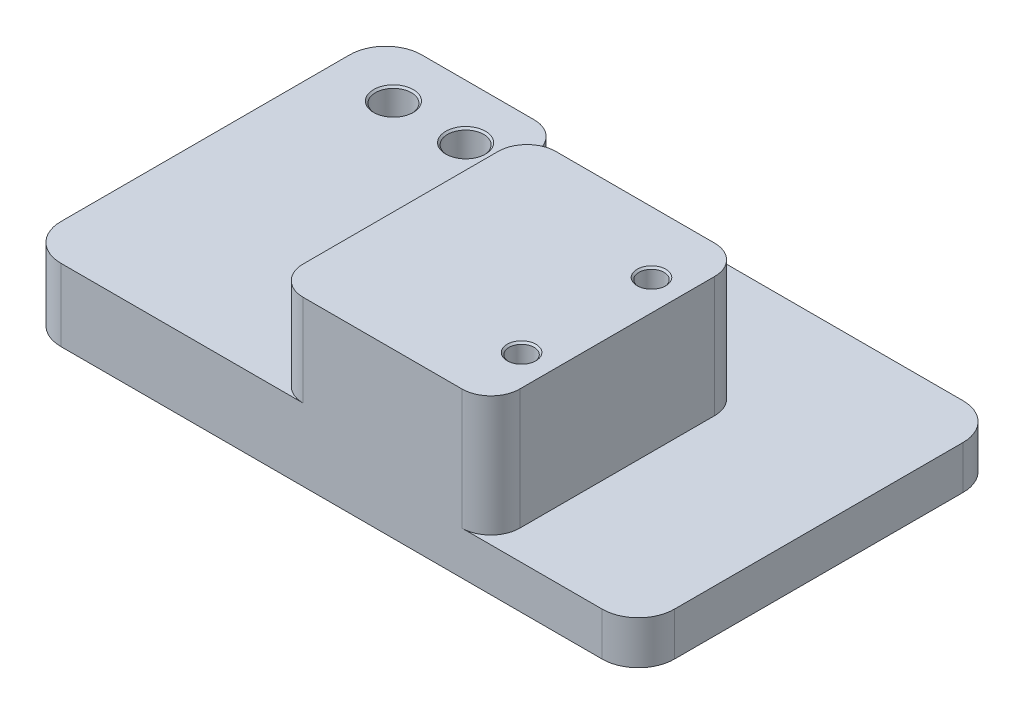
ISO-10303-21;
HEADER;
FILE_DESCRIPTION(('STEP AP214'),'2;1');
FILE_NAME('part.step','',(''),(''),'','','');
FILE_SCHEMA(('AUTOMOTIVE_DESIGN { 1 0 10303 214 1 1 1 1 }'));
ENDSEC;
DATA;
#1=APPLICATION_CONTEXT('core data for automotive mechanical design processes');
#2=APPLICATION_PROTOCOL_DEFINITION('international standard','automotive_design',2000,#1);
#3=PRODUCT_CONTEXT('',#1,'mechanical');
#4=PRODUCT('Part','Part','',(#3));
#5=PRODUCT_RELATED_PRODUCT_CATEGORY('part','',(#4));
#6=PRODUCT_DEFINITION_FORMATION('','',#4);
#7=PRODUCT_DEFINITION_CONTEXT('part definition',#1,'design');
#8=PRODUCT_DEFINITION('design','',#6,#7);
#9=PRODUCT_DEFINITION_SHAPE('','',#8);
#10=(LENGTH_UNIT() NAMED_UNIT(*) SI_UNIT(.MILLI.,.METRE.));
#11=(NAMED_UNIT(*) PLANE_ANGLE_UNIT() SI_UNIT($,.RADIAN.));
#12=(NAMED_UNIT(*) SI_UNIT($,.STERADIAN.) SOLID_ANGLE_UNIT());
#13=UNCERTAINTY_MEASURE_WITH_UNIT(LENGTH_MEASURE(1.E-05),#10,'distance_accuracy_value','');
#14=(GEOMETRIC_REPRESENTATION_CONTEXT(3) GLOBAL_UNCERTAINTY_ASSIGNED_CONTEXT((#13)) GLOBAL_UNIT_ASSIGNED_CONTEXT((#10,
#11,#12)) REPRESENTATION_CONTEXT('',''));
#15=CARTESIAN_POINT('',(0.,0.,0.));
#16=DIRECTION('',(0.,0.,1.));
#17=DIRECTION('',(1.,0.,0.));
#18=AXIS2_PLACEMENT_3D('',#15,#16,#17);
#19=CARTESIAN_POINT('',(0.,6.,0.));
#20=DIRECTION('',(0.,-1.,0.));
#21=DIRECTION('',(0.,0.,-1.));
#22=AXIS2_PLACEMENT_3D('',#19,#20,#21);
#23=PLANE('',#22);
#24=DIRECTION('',(0.,0.,-1.));
#25=VECTOR('',#24,1.);
#26=CARTESIAN_POINT('',(24.574331446899,6.,-50.));
#27=LINE('',#26,#25);
#28=CARTESIAN_POINT('',(24.574331446899,6.,-39.));
#29=VERTEX_POINT('',#28);
#30=CARTESIAN_POINT('',(24.574331446899,6.,-46.));
#31=VERTEX_POINT('',#30);
#32=EDGE_CURVE('E399',#29,#31,#27,.T.);
#33=ORIENTED_EDGE('',*,*,#32,.F.);
#34=CARTESIAN_POINT('',(28.574331446899,6.,-39.));
#35=DIRECTION('',(0.,-1.,0.));
#36=DIRECTION('',(0.,0.,-1.));
#37=AXIS2_PLACEMENT_3D('',#34,#35,#36);
#38=CIRCLE('',#37,4.);
#39=CARTESIAN_POINT('',(28.574331446899,6.,-35.));
#40=VERTEX_POINT('',#39);
#41=EDGE_CURVE('E328',#29,#40,#38,.F.);
#42=ORIENTED_EDGE('',*,*,#41,.T.);
#43=DIRECTION('',(-1.,0.,0.));
#44=VECTOR('',#43,1.);
#45=CARTESIAN_POINT('',(64.574331446899,6.,-35.));
#46=LINE('',#45,#44);
#47=CARTESIAN_POINT('',(60.574331446899,6.,-35.));
#48=VERTEX_POINT('',#47);
#49=EDGE_CURVE('E405',#48,#40,#46,.T.);
#50=ORIENTED_EDGE('',*,*,#49,.F.);
#51=CARTESIAN_POINT('',(60.574331446899,6.,-31.));
#52=DIRECTION('',(0.,-1.,0.));
#53=DIRECTION('',(0.,0.,-1.));
#54=AXIS2_PLACEMENT_3D('',#51,#52,#53);
#55=CIRCLE('',#54,4.);
#56=CARTESIAN_POINT('',(64.574331446899,6.,-31.));
#57=VERTEX_POINT('',#56);
#58=EDGE_CURVE('E314',#48,#57,#55,.T.);
#59=ORIENTED_EDGE('',*,*,#58,.T.);
#60=DIRECTION('',(0.,0.,-1.));
#61=VECTOR('',#60,1.);
#62=CARTESIAN_POINT('',(64.574331446899,6.,0.));
#63=LINE('',#62,#61);
#64=CARTESIAN_POINT('',(64.574331446899,6.,-4.));
#65=VERTEX_POINT('',#64);
#66=EDGE_CURVE('E832',#65,#57,#63,.T.);
#67=ORIENTED_EDGE('',*,*,#66,.F.);
#68=CARTESIAN_POINT('',(60.574331446899,6.,-4.));
#69=DIRECTION('',(0.,-1.,0.));
#70=DIRECTION('',(0.,0.,-1.));
#71=AXIS2_PLACEMENT_3D('',#68,#69,#70);
#72=CIRCLE('',#71,4.);
#73=CARTESIAN_POINT('',(60.574331446899,6.,0.));
#74=VERTEX_POINT('',#73);
#75=EDGE_CURVE('E310',#65,#74,#72,.T.);
#76=ORIENTED_EDGE('',*,*,#75,.T.);
#77=DIRECTION('',(1.,0.,0.));
#78=VECTOR('',#77,1.);
#79=CARTESIAN_POINT('',(0.,6.,0.));
#80=LINE('',#79,#78);
#81=CARTESIAN_POINT('',(80.,6.,0.));
#82=VERTEX_POINT('',#81);
#83=EDGE_CURVE('E218',#74,#82,#80,.T.);
#84=ORIENTED_EDGE('',*,*,#83,.T.);
#85=CARTESIAN_POINT('',(80.,6.,-5.));
#86=DIRECTION('',(0.,-1.,0.));
#87=DIRECTION('',(0.,0.,-1.));
#88=AXIS2_PLACEMENT_3D('',#85,#86,#87);
#89=CIRCLE('',#88,5.);
#90=CARTESIAN_POINT('',(85.,6.,-5.));
#91=VERTEX_POINT('',#90);
#92=EDGE_CURVE('E243',#82,#91,#89,.F.);
#93=ORIENTED_EDGE('',*,*,#92,.T.);
#94=DIRECTION('',(0.,0.,-1.));
#95=VECTOR('',#94,1.);
#96=CARTESIAN_POINT('',(85.,6.,0.));
#97=LINE('',#96,#95);
#98=CARTESIAN_POINT('',(85.,6.,-45.));
#99=VERTEX_POINT('',#98);
#100=EDGE_CURVE('E224',#91,#99,#97,.T.);
#101=ORIENTED_EDGE('',*,*,#100,.T.);
#102=CARTESIAN_POINT('',(80.,6.,-45.));
#103=DIRECTION('',(0.,-1.,0.));
#104=DIRECTION('',(0.,0.,-1.));
#105=AXIS2_PLACEMENT_3D('',#102,#103,#104);
#106=CIRCLE('',#105,5.);
#107=CARTESIAN_POINT('',(80.,6.,-50.));
#108=VERTEX_POINT('',#107);
#109=EDGE_CURVE('E246',#99,#108,#106,.F.);
#110=ORIENTED_EDGE('',*,*,#109,.T.);
#111=DIRECTION('',(-1.,0.,0.));
#112=VECTOR('',#111,1.);
#113=CARTESIAN_POINT('',(0.,6.,-50.));
#114=LINE('',#113,#112);
#115=CARTESIAN_POINT('',(20.574331446899,6.,-50.));
#116=VERTEX_POINT('',#115);
#117=EDGE_CURVE('E209',#108,#116,#114,.T.);
#118=ORIENTED_EDGE('',*,*,#117,.T.);
#119=CARTESIAN_POINT('',(20.574331446899,6.,-46.));
#120=DIRECTION('',(0.,-1.,0.));
#121=DIRECTION('',(0.,0.,-1.));
#122=AXIS2_PLACEMENT_3D('',#119,#120,#121);
#123=CIRCLE('',#122,4.);
#124=EDGE_CURVE('E62',#116,#31,#123,.T.);
#125=ORIENTED_EDGE('',*,*,#124,.T.);
#126=EDGE_LOOP('',(#33,#42,#50,#59,#67,#76,#84,#93,#101,#110,#118,#125));
#127=FACE_BOUND('',#126,.T.);
#128=ADVANCED_FACE('F45',(#127),#23,.F.);
#129=CARTESIAN_POINT('',(0.,6.,0.));
#130=DIRECTION('',(1.,0.,0.));
#131=DIRECTION('',(0.,0.,-1.));
#132=AXIS2_PLACEMENT_3D('',#129,#130,#131);
#133=PLANE('',#132);
#134=DIRECTION('',(0.,0.,1.));
#135=VECTOR('',#134,1.);
#136=CARTESIAN_POINT('',(0.,10.,0.));
#137=LINE('',#136,#135);
#138=CARTESIAN_POINT('',(0.,10.,-45.));
#139=VERTEX_POINT('',#138);
#140=CARTESIAN_POINT('',(0.,10.,-5.));
#141=VERTEX_POINT('',#140);
#142=EDGE_CURVE('E417',#139,#141,#137,.T.);
#143=ORIENTED_EDGE('',*,*,#142,.F.);
#144=DIRECTION('',(0.,-1.,0.));
#145=VECTOR('',#144,1.);
#146=CARTESIAN_POINT('',(0.,6.,-45.));
#147=LINE('',#146,#145);
#148=CARTESIAN_POINT('',(0.,0.,-45.));
#149=VERTEX_POINT('',#148);
#150=EDGE_CURVE('E259',#139,#149,#147,.T.);
#151=ORIENTED_EDGE('',*,*,#150,.T.);
#152=DIRECTION('',(0.,0.,1.));
#153=VECTOR('',#152,1.);
#154=CARTESIAN_POINT('',(0.,0.,0.));
#155=LINE('',#154,#153);
#156=CARTESIAN_POINT('',(0.,0.,-5.));
#157=VERTEX_POINT('',#156);
#158=EDGE_CURVE('E421',#149,#157,#155,.T.);
#159=ORIENTED_EDGE('',*,*,#158,.T.);
#160=DIRECTION('',(0.,-1.,0.));
#161=VECTOR('',#160,1.);
#162=CARTESIAN_POINT('',(0.,6.,-5.));
#163=LINE('',#162,#161);
#164=EDGE_CURVE('E256',#157,#141,#163,.F.);
#165=ORIENTED_EDGE('',*,*,#164,.T.);
#166=EDGE_LOOP('',(#143,#151,#159,#165));
#167=FACE_BOUND('',#166,.T.);
#168=ADVANCED_FACE('F453',(#167),#133,.F.);
#169=CARTESIAN_POINT('',(0.,6.,0.));
#170=DIRECTION('',(0.,0.,-1.));
#171=DIRECTION('',(-1.,0.,0.));
#172=AXIS2_PLACEMENT_3D('',#169,#170,#171);
#173=PLANE('',#172);
#174=ORIENTED_EDGE('',*,*,#83,.F.);
#175=DIRECTION('',(0.,-1.,0.));
#176=VECTOR('',#175,1.);
#177=CARTESIAN_POINT('',(60.574331446899,6.,0.));
#178=LINE('',#177,#176);
#179=CARTESIAN_POINT('',(60.574331446899,22.7,0.));
#180=VERTEX_POINT('',#179);
#181=EDGE_CURVE('E280',#74,#180,#178,.F.);
#182=ORIENTED_EDGE('',*,*,#181,.T.);
#183=DIRECTION('',(1.,0.,0.));
#184=VECTOR('',#183,1.);
#185=CARTESIAN_POINT('',(9.574331446899,22.7,0.));
#186=LINE('',#185,#184);
#187=CARTESIAN_POINT('',(38.574331446899,22.7,0.));
#188=VERTEX_POINT('',#187);
#189=EDGE_CURVE('E828',#188,#180,#186,.T.);
#190=ORIENTED_EDGE('',*,*,#189,.F.);
#191=DIRECTION('',(0.,1.,0.));
#192=VECTOR('',#191,1.);
#193=CARTESIAN_POINT('',(38.574331446899,6.,0.));
#194=LINE('',#193,#192);
#195=CARTESIAN_POINT('',(38.574331446899,10.,0.));
#196=VERTEX_POINT('',#195);
#197=EDGE_CURVE('E276',#188,#196,#194,.F.);
#198=ORIENTED_EDGE('',*,*,#197,.T.);
#199=DIRECTION('',(1.,0.,0.));
#200=VECTOR('',#199,1.);
#201=CARTESIAN_POINT('',(9.57433144689901,10.,0.));
#202=LINE('',#201,#200);
#203=CARTESIAN_POINT('',(5.,10.,0.));
#204=VERTEX_POINT('',#203);
#205=EDGE_CURVE('E408',#204,#196,#202,.T.);
#206=ORIENTED_EDGE('',*,*,#205,.F.);
#207=DIRECTION('',(0.,-1.,0.));
#208=VECTOR('',#207,1.);
#209=CARTESIAN_POINT('',(5.,6.,0.));
#210=LINE('',#209,#208);
#211=CARTESIAN_POINT('',(5.,0.,0.));
#212=VERTEX_POINT('',#211);
#213=EDGE_CURVE('E249',#204,#212,#210,.T.);
#214=ORIENTED_EDGE('',*,*,#213,.T.);
#215=DIRECTION('',(1.,0.,0.));
#216=VECTOR('',#215,1.);
#217=CARTESIAN_POINT('',(0.,0.,0.));
#218=LINE('',#217,#216);
#219=CARTESIAN_POINT('',(80.,0.,0.));
#220=VERTEX_POINT('',#219);
#221=EDGE_CURVE('E226',#212,#220,#218,.T.);
#222=ORIENTED_EDGE('',*,*,#221,.T.);
#223=DIRECTION('',(0.,-1.,0.));
#224=VECTOR('',#223,1.);
#225=CARTESIAN_POINT('',(80.,6.,0.));
#226=LINE('',#225,#224);
#227=EDGE_CURVE('E253',#220,#82,#226,.F.);
#228=ORIENTED_EDGE('',*,*,#227,.T.);
#229=EDGE_LOOP('',(#174,#182,#190,#198,#206,#214,#222,#228));
#230=FACE_BOUND('',#229,.T.);
#231=ADVANCED_FACE('F436',(#230),#173,.F.);
#232=CARTESIAN_POINT('',(85.,6.,0.));
#233=DIRECTION('',(-1.,0.,0.));
#234=DIRECTION('',(0.,0.,1.));
#235=AXIS2_PLACEMENT_3D('',#232,#233,#234);
#236=PLANE('',#235);
#237=DIRECTION('',(0.,0.,-1.));
#238=VECTOR('',#237,1.);
#239=CARTESIAN_POINT('',(85.,0.,0.));
#240=LINE('',#239,#238);
#241=CARTESIAN_POINT('',(85.,0.,-5.));
#242=VERTEX_POINT('',#241);
#243=CARTESIAN_POINT('',(85.,0.,-45.));
#244=VERTEX_POINT('',#243);
#245=EDGE_CURVE('E219',#242,#244,#240,.T.);
#246=ORIENTED_EDGE('',*,*,#245,.T.);
#247=DIRECTION('',(0.,-1.,0.));
#248=VECTOR('',#247,1.);
#249=CARTESIAN_POINT('',(85.,6.,-45.));
#250=LINE('',#249,#248);
#251=EDGE_CURVE('E191',#244,#99,#250,.F.);
#252=ORIENTED_EDGE('',*,*,#251,.T.);
#253=ORIENTED_EDGE('',*,*,#100,.F.);
#254=DIRECTION('',(0.,-1.,0.));
#255=VECTOR('',#254,1.);
#256=CARTESIAN_POINT('',(85.,6.,-5.));
#257=LINE('',#256,#255);
#258=EDGE_CURVE('E197',#91,#242,#257,.T.);
#259=ORIENTED_EDGE('',*,*,#258,.T.);
#260=EDGE_LOOP('',(#246,#252,#253,#259));
#261=FACE_BOUND('',#260,.T.);
#262=ADVANCED_FACE('F445',(#261),#236,.F.);
#263=CARTESIAN_POINT('',(0.,6.,-50.));
#264=DIRECTION('',(0.,0.,1.));
#265=DIRECTION('',(1.,0.,0.));
#266=AXIS2_PLACEMENT_3D('',#263,#264,#265);
#267=PLANE('',#266);
#268=DIRECTION('',(-1.,0.,0.));
#269=VECTOR('',#268,1.);
#270=CARTESIAN_POINT('',(0.,10.,-50.));
#271=LINE('',#270,#269);
#272=CARTESIAN_POINT('',(20.574331446899,10.,-50.));
#273=VERTEX_POINT('',#272);
#274=CARTESIAN_POINT('',(5.,10.,-50.));
#275=VERTEX_POINT('',#274);
#276=EDGE_CURVE('E414',#273,#275,#271,.T.);
#277=ORIENTED_EDGE('',*,*,#276,.F.);
#278=DIRECTION('',(0.,-1.,0.));
#279=VECTOR('',#278,1.);
#280=CARTESIAN_POINT('',(20.574331446899,6.,-50.));
#281=LINE('',#280,#279);
#282=EDGE_CURVE('E337',#273,#116,#281,.T.);
#283=ORIENTED_EDGE('',*,*,#282,.T.);
#284=ORIENTED_EDGE('',*,*,#117,.F.);
#285=DIRECTION('',(0.,-1.,0.));
#286=VECTOR('',#285,1.);
#287=CARTESIAN_POINT('',(80.,6.,-50.));
#288=LINE('',#287,#286);
#289=CARTESIAN_POINT('',(80.,0.,-50.));
#290=VERTEX_POINT('',#289);
#291=EDGE_CURVE('E190',#108,#290,#288,.T.);
#292=ORIENTED_EDGE('',*,*,#291,.T.);
#293=DIRECTION('',(-1.,0.,0.));
#294=VECTOR('',#293,1.);
#295=CARTESIAN_POINT('',(0.,0.,-50.));
#296=LINE('',#295,#294);
#297=CARTESIAN_POINT('',(5.,0.,-50.));
#298=VERTEX_POINT('',#297);
#299=EDGE_CURVE('E206',#290,#298,#296,.T.);
#300=ORIENTED_EDGE('',*,*,#299,.T.);
#301=DIRECTION('',(0.,-1.,0.));
#302=VECTOR('',#301,1.);
#303=CARTESIAN_POINT('',(5.,6.,-50.));
#304=LINE('',#303,#302);
#305=EDGE_CURVE('E212',#298,#275,#304,.F.);
#306=ORIENTED_EDGE('',*,*,#305,.T.);
#307=EDGE_LOOP('',(#277,#283,#284,#292,#300,#306));
#308=FACE_BOUND('',#307,.T.);
#309=ADVANCED_FACE('F204',(#308),#267,.F.);
#310=CARTESIAN_POINT('',(0.,0.,0.));
#311=DIRECTION('',(0.,-1.,0.));
#312=DIRECTION('',(0.,0.,-1.));
#313=AXIS2_PLACEMENT_3D('',#310,#311,#312);
#314=PLANE('',#313);
#315=CARTESIAN_POINT('',(18.574331446899,0.,-42.5));
#316=DIRECTION('',(0.,-1.,0.));
#317=DIRECTION('',(0.,0.,-1.));
#318=AXIS2_PLACEMENT_3D('',#315,#316,#317);
#319=CIRCLE('',#318,2.5);
#320=CARTESIAN_POINT('',(18.574331446899,0.,-45.));
#321=VERTEX_POINT('',#320);
#322=EDGE_CURVE('E393',#321,#321,#319,.T.);
#323=ORIENTED_EDGE('',*,*,#322,.F.);
#324=EDGE_LOOP('',(#323));
#325=FACE_BOUND('',#324,.T.);
#326=CARTESIAN_POINT('',(8.574331446899,0.,-42.5));
#327=DIRECTION('',(0.,-1.,0.));
#328=DIRECTION('',(0.,0.,-1.));
#329=AXIS2_PLACEMENT_3D('',#326,#327,#328);
#330=CIRCLE('',#329,2.5);
#331=CARTESIAN_POINT('',(8.574331446899,0.,-45.));
#332=VERTEX_POINT('',#331);
#333=EDGE_CURVE('E390',#332,#332,#330,.T.);
#334=ORIENTED_EDGE('',*,*,#333,.F.);
#335=EDGE_LOOP('',(#334));
#336=FACE_BOUND('',#335,.T.);
#337=ORIENTED_EDGE('',*,*,#299,.F.);
#338=CARTESIAN_POINT('',(80.,0.,-45.));
#339=DIRECTION('',(0.,-1.,0.));
#340=DIRECTION('',(0.,0.,-1.));
#341=AXIS2_PLACEMENT_3D('',#338,#339,#340);
#342=CIRCLE('',#341,5.);
#343=EDGE_CURVE('E186',#290,#244,#342,.T.);
#344=ORIENTED_EDGE('',*,*,#343,.T.);
#345=ORIENTED_EDGE('',*,*,#245,.F.);
#346=CARTESIAN_POINT('',(80.,0.,-5.));
#347=DIRECTION('',(0.,-1.,0.));
#348=DIRECTION('',(0.,0.,-1.));
#349=AXIS2_PLACEMENT_3D('',#346,#347,#348);
#350=CIRCLE('',#349,5.);
#351=EDGE_CURVE('E198',#242,#220,#350,.T.);
#352=ORIENTED_EDGE('',*,*,#351,.T.);
#353=ORIENTED_EDGE('',*,*,#221,.F.);
#354=CARTESIAN_POINT('',(5.,0.,-5.));
#355=DIRECTION('',(0.,-1.,0.));
#356=DIRECTION('',(0.,0.,-1.));
#357=AXIS2_PLACEMENT_3D('',#354,#355,#356);
#358=CIRCLE('',#357,5.);
#359=EDGE_CURVE('E211',#212,#157,#358,.T.);
#360=ORIENTED_EDGE('',*,*,#359,.T.);
#361=ORIENTED_EDGE('',*,*,#158,.F.);
#362=CARTESIAN_POINT('',(5.,0.,-45.));
#363=DIRECTION('',(0.,-1.,0.));
#364=DIRECTION('',(0.,0.,-1.));
#365=AXIS2_PLACEMENT_3D('',#362,#363,#364);
#366=CIRCLE('',#365,5.);
#367=EDGE_CURVE('E216',#149,#298,#366,.T.);
#368=ORIENTED_EDGE('',*,*,#367,.T.);
#369=EDGE_LOOP('',(#337,#344,#345,#352,#353,#360,#361,#368));
#370=FACE_BOUND('',#369,.T.);
#371=ADVANCED_FACE('F214',(#325,#336,#370),#314,.T.);
#372=CARTESIAN_POINT('',(24.574331446899,10.,-50.));
#373=DIRECTION('',(-1.,0.,0.));
#374=DIRECTION('',(0.,0.,1.));
#375=AXIS2_PLACEMENT_3D('',#372,#373,#374);
#376=PLANE('',#375);
#377=ORIENTED_EDGE('',*,*,#32,.T.);
#378=DIRECTION('',(0.,-1.,0.));
#379=VECTOR('',#378,1.);
#380=CARTESIAN_POINT('',(24.574331446899,10.,-46.));
#381=LINE('',#380,#379);
#382=CARTESIAN_POINT('',(24.574331446899,10.,-46.));
#383=VERTEX_POINT('',#382);
#384=EDGE_CURVE('E69',#31,#383,#381,.F.);
#385=ORIENTED_EDGE('',*,*,#384,.T.);
#386=DIRECTION('',(0.,0.,-1.));
#387=VECTOR('',#386,1.);
#388=CARTESIAN_POINT('',(24.574331446899,10.,-50.));
#389=LINE('',#388,#387);
#390=CARTESIAN_POINT('',(24.574331446899,10.,-39.));
#391=VERTEX_POINT('',#390);
#392=EDGE_CURVE('E411',#391,#383,#389,.T.);
#393=ORIENTED_EDGE('',*,*,#392,.F.);
#394=DIRECTION('',(0.,-1.,0.));
#395=VECTOR('',#394,1.);
#396=CARTESIAN_POINT('',(24.574331446899,6.,-39.));
#397=LINE('',#396,#395);
#398=EDGE_CURVE('E324',#391,#29,#397,.T.);
#399=ORIENTED_EDGE('',*,*,#398,.T.);
#400=EDGE_LOOP('',(#377,#385,#393,#399));
#401=FACE_BOUND('',#400,.T.);
#402=ADVANCED_FACE('F464',(#401),#376,.F.);
#403=CARTESIAN_POINT('',(0.,10.,0.));
#404=DIRECTION('',(0.,-1.,0.));
#405=DIRECTION('',(0.,0.,-1.));
#406=AXIS2_PLACEMENT_3D('',#403,#404,#405);
#407=PLANE('',#406);
#408=CARTESIAN_POINT('',(8.574331446899,10.,-42.5));
#409=DIRECTION('',(0.,-1.,0.));
#410=DIRECTION('',(0.,0.,-1.));
#411=AXIS2_PLACEMENT_3D('',#408,#409,#410);
#412=CIRCLE('',#411,2.74999999999999);
#413=CARTESIAN_POINT('',(8.574331446899,10.,-45.25));
#414=VERTEX_POINT('',#413);
#415=EDGE_CURVE('E55',#414,#414,#412,.T.);
#416=ORIENTED_EDGE('',*,*,#415,.T.);
#417=EDGE_LOOP('',(#416));
#418=FACE_BOUND('',#417,.T.);
#419=CARTESIAN_POINT('',(18.574331446899,10.,-42.5));
#420=DIRECTION('',(0.,-1.,0.));
#421=DIRECTION('',(0.,0.,-1.));
#422=AXIS2_PLACEMENT_3D('',#419,#420,#421);
#423=CIRCLE('',#422,2.75);
#424=CARTESIAN_POINT('',(18.574331446899,10.,-45.25));
#425=VERTEX_POINT('',#424);
#426=EDGE_CURVE('E367',#425,#425,#423,.T.);
#427=ORIENTED_EDGE('',*,*,#426,.T.);
#428=EDGE_LOOP('',(#427));
#429=FACE_BOUND('',#428,.T.);
#430=ORIENTED_EDGE('',*,*,#392,.T.);
#431=CARTESIAN_POINT('',(20.574331446899,10.,-46.));
#432=DIRECTION('',(0.,-1.,0.));
#433=DIRECTION('',(0.,0.,-1.));
#434=AXIS2_PLACEMENT_3D('',#431,#432,#433);
#435=CIRCLE('',#434,4.);
#436=EDGE_CURVE('E342',#383,#273,#435,.F.);
#437=ORIENTED_EDGE('',*,*,#436,.T.);
#438=ORIENTED_EDGE('',*,*,#276,.T.);
#439=CARTESIAN_POINT('',(5.,10.,-45.));
#440=DIRECTION('',(0.,-1.,0.));
#441=DIRECTION('',(0.,0.,-1.));
#442=AXIS2_PLACEMENT_3D('',#439,#440,#441);
#443=CIRCLE('',#442,5.);
#444=EDGE_CURVE('E266',#275,#139,#443,.F.);
#445=ORIENTED_EDGE('',*,*,#444,.T.);
#446=ORIENTED_EDGE('',*,*,#142,.T.);
#447=CARTESIAN_POINT('',(5.,10.,-5.));
#448=DIRECTION('',(0.,-1.,0.));
#449=DIRECTION('',(0.,0.,-1.));
#450=AXIS2_PLACEMENT_3D('',#447,#448,#449);
#451=CIRCLE('',#450,5.);
#452=EDGE_CURVE('E263',#141,#204,#451,.F.);
#453=ORIENTED_EDGE('',*,*,#452,.T.);
#454=ORIENTED_EDGE('',*,*,#205,.T.);
#455=CARTESIAN_POINT('',(38.574331446899,10.,-4.));
#456=DIRECTION('',(0.,-1.,0.));
#457=DIRECTION('',(0.,0.,-1.));
#458=AXIS2_PLACEMENT_3D('',#455,#456,#457);
#459=CIRCLE('',#458,4.);
#460=CARTESIAN_POINT('',(34.574331446899,10.,-4.));
#461=VERTEX_POINT('',#460);
#462=EDGE_CURVE('E321',#196,#461,#459,.T.);
#463=ORIENTED_EDGE('',*,*,#462,.T.);
#464=DIRECTION('',(0.,0.,-1.));
#465=VECTOR('',#464,1.);
#466=CARTESIAN_POINT('',(34.574331446899,10.,-35.));
#467=LINE('',#466,#465);
#468=CARTESIAN_POINT('',(34.574331446899,10.,-31.));
#469=VERTEX_POINT('',#468);
#470=EDGE_CURVE('E850',#461,#469,#467,.T.);
#471=ORIENTED_EDGE('',*,*,#470,.T.);
#472=CARTESIAN_POINT('',(38.574331446899,10.,-31.));
#473=DIRECTION('',(0.,-1.,0.));
#474=DIRECTION('',(0.,0.,-1.));
#475=AXIS2_PLACEMENT_3D('',#472,#473,#474);
#476=CIRCLE('',#475,4.);
#477=CARTESIAN_POINT('',(38.574331446899,10.,-35.));
#478=VERTEX_POINT('',#477);
#479=EDGE_CURVE('E317',#469,#478,#476,.T.);
#480=ORIENTED_EDGE('',*,*,#479,.T.);
#481=DIRECTION('',(-1.,0.,0.));
#482=VECTOR('',#481,1.);
#483=CARTESIAN_POINT('',(9.57433144689901,10.,-35.));
#484=LINE('',#483,#482);
#485=CARTESIAN_POINT('',(28.574331446899,10.,-35.));
#486=VERTEX_POINT('',#485);
#487=EDGE_CURVE('E848',#478,#486,#484,.T.);
#488=ORIENTED_EDGE('',*,*,#487,.T.);
#489=CARTESIAN_POINT('',(28.574331446899,10.,-39.));
#490=DIRECTION('',(0.,-1.,0.));
#491=DIRECTION('',(0.,0.,-1.));
#492=AXIS2_PLACEMENT_3D('',#489,#490,#491);
#493=CIRCLE('',#492,4.);
#494=EDGE_CURVE('E334',#486,#391,#493,.T.);
#495=ORIENTED_EDGE('',*,*,#494,.T.);
#496=EDGE_LOOP('',(#430,#437,#438,#445,#446,#453,#454,#463,#471,#480,#488,#495));
#497=FACE_BOUND('',#496,.T.);
#498=ADVANCED_FACE('F374',(#418,#429,#497),#407,.F.);
#499=CARTESIAN_POINT('',(8.574331446899,-0.999999999999999,-42.5));
#500=DIRECTION('',(0.,1.,0.));
#501=DIRECTION('',(0.,0.,1.));
#502=AXIS2_PLACEMENT_3D('',#499,#500,#501);
#503=CYLINDRICAL_SURFACE('',#502,2.5);
#504=CARTESIAN_POINT('',(8.574331446899,9.75000000000001,-42.5));
#505=DIRECTION('',(0.,-1.,0.));
#506=DIRECTION('',(0.,0.,-1.));
#507=AXIS2_PLACEMENT_3D('',#504,#505,#506);
#508=CIRCLE('',#507,2.5);
#509=CARTESIAN_POINT('',(8.574331446899,9.75000000000001,-45.));
#510=VERTEX_POINT('',#509);
#511=EDGE_CURVE('E363',#510,#510,#508,.F.);
#512=ORIENTED_EDGE('',*,*,#511,.T.);
#513=EDGE_LOOP('',(#512));
#514=FACE_BOUND('',#513,.T.);
#515=ORIENTED_EDGE('',*,*,#333,.T.);
#516=EDGE_LOOP('',(#515));
#517=FACE_BOUND('',#516,.T.);
#518=ADVANCED_FACE('F383',(#514,#517),#503,.F.);
#519=CARTESIAN_POINT('',(18.574331446899,-0.999999999999999,-42.5));
#520=DIRECTION('',(0.,1.,0.));
#521=DIRECTION('',(0.,0.,1.));
#522=AXIS2_PLACEMENT_3D('',#519,#520,#521);
#523=CYLINDRICAL_SURFACE('',#522,2.5);
#524=CARTESIAN_POINT('',(18.574331446899,9.75,-42.5));
#525=DIRECTION('',(0.,-1.,0.));
#526=DIRECTION('',(0.,0.,-1.));
#527=AXIS2_PLACEMENT_3D('',#524,#525,#526);
#528=CIRCLE('',#527,2.5);
#529=CARTESIAN_POINT('',(18.574331446899,9.75,-45.));
#530=VERTEX_POINT('',#529);
#531=EDGE_CURVE('E11',#530,#530,#528,.F.);
#532=ORIENTED_EDGE('',*,*,#531,.T.);
#533=EDGE_LOOP('',(#532));
#534=FACE_BOUND('',#533,.T.);
#535=ORIENTED_EDGE('',*,*,#322,.T.);
#536=EDGE_LOOP('',(#535));
#537=FACE_BOUND('',#536,.T.);
#538=ADVANCED_FACE('F386',(#534,#537),#523,.F.);
#539=CARTESIAN_POINT('',(64.574331446899,22.7,-35.));
#540=DIRECTION('',(0.,0.,1.));
#541=DIRECTION('',(1.,0.,0.));
#542=AXIS2_PLACEMENT_3D('',#539,#540,#541);
#543=PLANE('',#542);
#544=ORIENTED_EDGE('',*,*,#49,.T.);
#545=DIRECTION('',(0.,-1.,0.));
#546=VECTOR('',#545,1.);
#547=CARTESIAN_POINT('',(28.574331446899,10.,-35.));
#548=LINE('',#547,#546);
#549=EDGE_CURVE('E331',#40,#486,#548,.F.);
#550=ORIENTED_EDGE('',*,*,#549,.T.);
#551=ORIENTED_EDGE('',*,*,#487,.F.);
#552=DIRECTION('',(0.,1.,0.));
#553=VECTOR('',#552,1.);
#554=CARTESIAN_POINT('',(38.574331446899,22.7,-35.));
#555=LINE('',#554,#553);
#556=CARTESIAN_POINT('',(38.574331446899,22.7,-35.));
#557=VERTEX_POINT('',#556);
#558=EDGE_CURVE('E295',#478,#557,#555,.T.);
#559=ORIENTED_EDGE('',*,*,#558,.T.);
#560=DIRECTION('',(-1.,0.,0.));
#561=VECTOR('',#560,1.);
#562=CARTESIAN_POINT('',(64.574331446899,22.7,-35.));
#563=LINE('',#562,#561);
#564=CARTESIAN_POINT('',(60.574331446899,22.7,-35.));
#565=VERTEX_POINT('',#564);
#566=EDGE_CURVE('E394',#565,#557,#563,.T.);
#567=ORIENTED_EDGE('',*,*,#566,.F.);
#568=DIRECTION('',(0.,-1.,0.));
#569=VECTOR('',#568,1.);
#570=CARTESIAN_POINT('',(60.574331446899,22.7,-35.));
#571=LINE('',#570,#569);
#572=EDGE_CURVE('E299',#565,#48,#571,.T.);
#573=ORIENTED_EDGE('',*,*,#572,.T.);
#574=EDGE_LOOP('',(#544,#550,#551,#559,#567,#573));
#575=FACE_BOUND('',#574,.T.);
#576=ADVANCED_FACE('F474',(#575),#543,.F.);
#577=CARTESIAN_POINT('',(64.574331446899,22.7,0.));
#578=DIRECTION('',(-1.,0.,0.));
#579=DIRECTION('',(0.,0.,1.));
#580=AXIS2_PLACEMENT_3D('',#577,#578,#579);
#581=PLANE('',#580);
#582=DIRECTION('',(0.,0.,-1.));
#583=VECTOR('',#582,1.);
#584=CARTESIAN_POINT('',(64.574331446899,22.7,0.));
#585=LINE('',#584,#583);
#586=CARTESIAN_POINT('',(64.574331446899,22.7,-4.));
#587=VERTEX_POINT('',#586);
#588=CARTESIAN_POINT('',(64.574331446899,22.7,-31.));
#589=VERTEX_POINT('',#588);
#590=EDGE_CURVE('E402',#587,#589,#585,.T.);
#591=ORIENTED_EDGE('',*,*,#590,.F.);
#592=DIRECTION('',(0.,-1.,0.));
#593=VECTOR('',#592,1.);
#594=CARTESIAN_POINT('',(64.574331446899,22.7,-4.));
#595=LINE('',#594,#593);
#596=EDGE_CURVE('E272',#587,#65,#595,.T.);
#597=ORIENTED_EDGE('',*,*,#596,.T.);
#598=ORIENTED_EDGE('',*,*,#66,.T.);
#599=DIRECTION('',(0.,-1.,0.));
#600=VECTOR('',#599,1.);
#601=CARTESIAN_POINT('',(64.574331446899,22.7,-31.));
#602=LINE('',#601,#600);
#603=EDGE_CURVE('E269',#57,#589,#602,.F.);
#604=ORIENTED_EDGE('',*,*,#603,.T.);
#605=EDGE_LOOP('',(#591,#597,#598,#604));
#606=FACE_BOUND('',#605,.T.);
#607=ADVANCED_FACE('F480',(#606),#581,.F.);
#608=CARTESIAN_POINT('',(0.,22.7,0.));
#609=DIRECTION('',(0.,1.,0.));
#610=DIRECTION('',(0.,0.,1.));
#611=AXIS2_PLACEMENT_3D('',#608,#609,#610);
#612=PLANE('',#611);
#613=CARTESIAN_POINT('',(60.324331446899,22.7,-8.50000000000001));
#614=DIRECTION('',(0.,1.,0.));
#615=DIRECTION('',(0.,0.,1.));
#616=AXIS2_PLACEMENT_3D('',#613,#614,#615);
#617=CIRCLE('',#616,1.99000000000002);
#618=CARTESIAN_POINT('',(60.324331446899,22.7,-6.50999999999999));
#619=VERTEX_POINT('',#618);
#620=EDGE_CURVE('E355',#619,#619,#617,.F.);
#621=ORIENTED_EDGE('',*,*,#620,.T.);
#622=EDGE_LOOP('',(#621));
#623=FACE_BOUND('',#622,.T.);
#624=CARTESIAN_POINT('',(60.324331446899,22.7,-26.5));
#625=DIRECTION('',(0.,1.,0.));
#626=DIRECTION('',(0.,0.,1.));
#627=AXIS2_PLACEMENT_3D('',#624,#625,#626);
#628=CIRCLE('',#627,1.99000000000002);
#629=CARTESIAN_POINT('',(60.324331446899,22.7,-24.51));
#630=VERTEX_POINT('',#629);
#631=EDGE_CURVE('E351',#630,#630,#628,.F.);
#632=ORIENTED_EDGE('',*,*,#631,.T.);
#633=EDGE_LOOP('',(#632));
#634=FACE_BOUND('',#633,.T.);
#635=ORIENTED_EDGE('',*,*,#189,.T.);
#636=CARTESIAN_POINT('',(60.574331446899,22.7,-4.));
#637=DIRECTION('',(0.,1.,0.));
#638=DIRECTION('',(0.,0.,1.));
#639=AXIS2_PLACEMENT_3D('',#636,#637,#638);
#640=CIRCLE('',#639,4.);
#641=EDGE_CURVE('E292',#180,#587,#640,.T.);
#642=ORIENTED_EDGE('',*,*,#641,.T.);
#643=ORIENTED_EDGE('',*,*,#590,.T.);
#644=CARTESIAN_POINT('',(60.574331446899,22.7,-31.));
#645=DIRECTION('',(0.,1.,0.));
#646=DIRECTION('',(0.,0.,1.));
#647=AXIS2_PLACEMENT_3D('',#644,#645,#646);
#648=CIRCLE('',#647,4.);
#649=EDGE_CURVE('E289',#589,#565,#648,.T.);
#650=ORIENTED_EDGE('',*,*,#649,.T.);
#651=ORIENTED_EDGE('',*,*,#566,.T.);
#652=CARTESIAN_POINT('',(38.574331446899,22.7,-31.));
#653=DIRECTION('',(0.,1.,0.));
#654=DIRECTION('',(0.,0.,1.));
#655=AXIS2_PLACEMENT_3D('',#652,#653,#654);
#656=CIRCLE('',#655,4.);
#657=CARTESIAN_POINT('',(34.574331446899,22.7,-31.));
#658=VERTEX_POINT('',#657);
#659=EDGE_CURVE('E286',#557,#658,#656,.T.);
#660=ORIENTED_EDGE('',*,*,#659,.T.);
#661=DIRECTION('',(0.,0.,-1.));
#662=VECTOR('',#661,1.);
#663=CARTESIAN_POINT('',(34.574331446899,22.7,-35.));
#664=LINE('',#663,#662);
#665=CARTESIAN_POINT('',(34.574331446899,22.7,-4.));
#666=VERTEX_POINT('',#665);
#667=EDGE_CURVE('E854',#666,#658,#664,.T.);
#668=ORIENTED_EDGE('',*,*,#667,.F.);
#669=CARTESIAN_POINT('',(38.574331446899,22.7,-4.));
#670=DIRECTION('',(0.,1.,0.));
#671=DIRECTION('',(0.,0.,1.));
#672=AXIS2_PLACEMENT_3D('',#669,#670,#671);
#673=CIRCLE('',#672,4.);
#674=EDGE_CURVE('E283',#666,#188,#673,.T.);
#675=ORIENTED_EDGE('',*,*,#674,.T.);
#676=EDGE_LOOP('',(#635,#642,#643,#650,#651,#660,#668,#675));
#677=FACE_BOUND('',#676,.T.);
#678=ADVANCED_FACE('F507',(#623,#634,#677),#612,.T.);
#679=CARTESIAN_POINT('',(80.,6.,-45.));
#680=DIRECTION('',(0.,-1.,0.));
#681=DIRECTION('',(0.,0.,-1.));
#682=AXIS2_PLACEMENT_3D('',#679,#680,#681);
#683=CYLINDRICAL_SURFACE('',#682,5.);
#684=ORIENTED_EDGE('',*,*,#109,.F.);
#685=ORIENTED_EDGE('',*,*,#251,.F.);
#686=ORIENTED_EDGE('',*,*,#343,.F.);
#687=ORIENTED_EDGE('',*,*,#291,.F.);
#688=EDGE_LOOP('',(#684,#685,#686,#687));
#689=FACE_BOUND('',#688,.T.);
#690=ADVANCED_FACE('F189',(#689),#683,.T.);
#691=CARTESIAN_POINT('',(80.,6.,-5.));
#692=DIRECTION('',(0.,-1.,0.));
#693=DIRECTION('',(0.,0.,-1.));
#694=AXIS2_PLACEMENT_3D('',#691,#692,#693);
#695=CYLINDRICAL_SURFACE('',#694,5.);
#696=ORIENTED_EDGE('',*,*,#92,.F.);
#697=ORIENTED_EDGE('',*,*,#227,.F.);
#698=ORIENTED_EDGE('',*,*,#351,.F.);
#699=ORIENTED_EDGE('',*,*,#258,.F.);
#700=EDGE_LOOP('',(#696,#697,#698,#699));
#701=FACE_BOUND('',#700,.T.);
#702=ADVANCED_FACE('F441',(#701),#695,.T.);
#703=CARTESIAN_POINT('',(5.,6.,-45.));
#704=DIRECTION('',(0.,-1.,0.));
#705=DIRECTION('',(0.,0.,-1.));
#706=AXIS2_PLACEMENT_3D('',#703,#704,#705);
#707=CYLINDRICAL_SURFACE('',#706,5.);
#708=ORIENTED_EDGE('',*,*,#444,.F.);
#709=ORIENTED_EDGE('',*,*,#305,.F.);
#710=ORIENTED_EDGE('',*,*,#367,.F.);
#711=ORIENTED_EDGE('',*,*,#150,.F.);
#712=EDGE_LOOP('',(#708,#709,#710,#711));
#713=FACE_BOUND('',#712,.T.);
#714=ADVANCED_FACE('F681',(#713),#707,.T.);
#715=CARTESIAN_POINT('',(5.,6.,-5.));
#716=DIRECTION('',(0.,-1.,0.));
#717=DIRECTION('',(0.,0.,-1.));
#718=AXIS2_PLACEMENT_3D('',#715,#716,#717);
#719=CYLINDRICAL_SURFACE('',#718,5.);
#720=ORIENTED_EDGE('',*,*,#452,.F.);
#721=ORIENTED_EDGE('',*,*,#164,.F.);
#722=ORIENTED_EDGE('',*,*,#359,.F.);
#723=ORIENTED_EDGE('',*,*,#213,.F.);
#724=EDGE_LOOP('',(#720,#721,#722,#723));
#725=FACE_BOUND('',#724,.T.);
#726=ADVANCED_FACE('F528',(#725),#719,.T.);
#727=CARTESIAN_POINT('',(60.324331446899,12.7,-8.50000000000001));
#728=DIRECTION('',(0.,1.,0.));
#729=DIRECTION('',(0.,0.,1.));
#730=AXIS2_PLACEMENT_3D('',#727,#728,#729);
#731=CYLINDRICAL_SURFACE('',#730,1.74);
#732=CARTESIAN_POINT('',(60.324331446899,22.45,-8.50000000000001));
#733=DIRECTION('',(0.,1.,0.));
#734=DIRECTION('',(0.,0.,1.));
#735=AXIS2_PLACEMENT_3D('',#732,#733,#734);
#736=CIRCLE('',#735,1.74);
#737=CARTESIAN_POINT('',(60.324331446899,22.45,-6.76000000000001));
#738=VERTEX_POINT('',#737);
#739=EDGE_CURVE('E347',#738,#738,#736,.T.);
#740=ORIENTED_EDGE('',*,*,#739,.T.);
#741=EDGE_LOOP('',(#740));
#742=FACE_BOUND('',#741,.T.);
#743=CARTESIAN_POINT('',(60.324331446899,12.7,-8.50000000000001));
#744=DIRECTION('',(0.,1.,0.));
#745=DIRECTION('',(0.,0.,-1.));
#746=AXIS2_PLACEMENT_3D('',#743,#744,#745);
#747=CIRCLE('',#746,1.74);
#748=CARTESIAN_POINT('',(60.324331446899,12.7,-10.24));
#749=VERTEX_POINT('',#748);
#750=EDGE_CURVE('E840',#749,#749,#747,.T.);
#751=ORIENTED_EDGE('',*,*,#750,.F.);
#752=EDGE_LOOP('',(#751));
#753=FACE_BOUND('',#752,.T.);
#754=ADVANCED_FACE('F522',(#742,#753),#731,.F.);
#755=CARTESIAN_POINT('',(60.324331446899,12.7,-8.50000000000001));
#756=DIRECTION('',(0.,-1.,0.));
#757=DIRECTION('',(0.,0.,-1.));
#758=AXIS2_PLACEMENT_3D('',#755,#756,#757);
#759=PLANE('',#758);
#760=ORIENTED_EDGE('',*,*,#750,.T.);
#761=EDGE_LOOP('',(#760));
#762=FACE_BOUND('',#761,.T.);
#763=ADVANCED_FACE('F527',(#762),#759,.F.);
#764=CARTESIAN_POINT('',(60.324331446899,12.7,-26.5));
#765=DIRECTION('',(0.,1.,0.));
#766=DIRECTION('',(0.,0.,1.));
#767=AXIS2_PLACEMENT_3D('',#764,#765,#766);
#768=CYLINDRICAL_SURFACE('',#767,1.74);
#769=CARTESIAN_POINT('',(60.324331446899,22.45,-26.5));
#770=DIRECTION('',(0.,1.,0.));
#771=DIRECTION('',(0.,0.,1.));
#772=AXIS2_PLACEMENT_3D('',#769,#770,#771);
#773=CIRCLE('',#772,1.74);
#774=CARTESIAN_POINT('',(60.324331446899,22.45,-24.76));
#775=VERTEX_POINT('',#774);
#776=EDGE_CURVE('E359',#775,#775,#773,.T.);
#777=ORIENTED_EDGE('',*,*,#776,.T.);
#778=EDGE_LOOP('',(#777));
#779=FACE_BOUND('',#778,.T.);
#780=CARTESIAN_POINT('',(60.324331446899,12.7,-26.5));
#781=DIRECTION('',(0.,1.,0.));
#782=DIRECTION('',(0.,0.,1.));
#783=AXIS2_PLACEMENT_3D('',#780,#781,#782);
#784=CIRCLE('',#783,1.74);
#785=CARTESIAN_POINT('',(60.324331446899,12.7,-24.76));
#786=VERTEX_POINT('',#785);
#787=EDGE_CURVE('E835',#786,#786,#784,.T.);
#788=ORIENTED_EDGE('',*,*,#787,.F.);
#789=EDGE_LOOP('',(#788));
#790=FACE_BOUND('',#789,.T.);
#791=ADVANCED_FACE('F539',(#779,#790),#768,.F.);
#792=CARTESIAN_POINT('',(60.324331446899,12.7,-26.5));
#793=DIRECTION('',(0.,1.,0.));
#794=DIRECTION('',(0.,0.,1.));
#795=AXIS2_PLACEMENT_3D('',#792,#793,#794);
#796=PLANE('',#795);
#797=ORIENTED_EDGE('',*,*,#787,.T.);
#798=EDGE_LOOP('',(#797));
#799=FACE_BOUND('',#798,.T.);
#800=ADVANCED_FACE('F544',(#799),#796,.T.);
#801=CARTESIAN_POINT('',(34.574331446899,-33.0116263352131,-35.));
#802=DIRECTION('',(1.,0.,0.));
#803=DIRECTION('',(0.,0.,-1.));
#804=AXIS2_PLACEMENT_3D('',#801,#802,#803);
#805=PLANE('',#804);
#806=ORIENTED_EDGE('',*,*,#667,.T.);
#807=DIRECTION('',(0.,1.,0.));
#808=VECTOR('',#807,1.);
#809=CARTESIAN_POINT('',(34.574331446899,-33.0116263352131,-31.));
#810=LINE('',#809,#808);
#811=EDGE_CURVE('E307',#658,#469,#810,.F.);
#812=ORIENTED_EDGE('',*,*,#811,.T.);
#813=ORIENTED_EDGE('',*,*,#470,.F.);
#814=DIRECTION('',(0.,1.,0.));
#815=VECTOR('',#814,1.);
#816=CARTESIAN_POINT('',(34.574331446899,-33.0116263352131,-4.));
#817=LINE('',#816,#815);
#818=EDGE_CURVE('E303',#461,#666,#817,.T.);
#819=ORIENTED_EDGE('',*,*,#818,.T.);
#820=EDGE_LOOP('',(#806,#812,#813,#819));
#821=FACE_BOUND('',#820,.T.);
#822=ADVANCED_FACE('F648',(#821),#805,.F.);
#823=CARTESIAN_POINT('',(60.574331446899,22.7,-4.));
#824=DIRECTION('',(0.,-1.,0.));
#825=DIRECTION('',(0.,0.,-1.));
#826=AXIS2_PLACEMENT_3D('',#823,#824,#825);
#827=CYLINDRICAL_SURFACE('',#826,4.);
#828=ORIENTED_EDGE('',*,*,#641,.F.);
#829=ORIENTED_EDGE('',*,*,#181,.F.);
#830=ORIENTED_EDGE('',*,*,#75,.F.);
#831=ORIENTED_EDGE('',*,*,#596,.F.);
#832=EDGE_LOOP('',(#828,#829,#830,#831));
#833=FACE_BOUND('',#832,.T.);
#834=ADVANCED_FACE('F638',(#833),#827,.T.);
#835=CARTESIAN_POINT('',(60.574331446899,22.7,-31.));
#836=DIRECTION('',(0.,-1.,0.));
#837=DIRECTION('',(0.,0.,-1.));
#838=AXIS2_PLACEMENT_3D('',#835,#836,#837);
#839=CYLINDRICAL_SURFACE('',#838,4.);
#840=ORIENTED_EDGE('',*,*,#649,.F.);
#841=ORIENTED_EDGE('',*,*,#603,.F.);
#842=ORIENTED_EDGE('',*,*,#58,.F.);
#843=ORIENTED_EDGE('',*,*,#572,.F.);
#844=EDGE_LOOP('',(#840,#841,#842,#843));
#845=FACE_BOUND('',#844,.T.);
#846=ADVANCED_FACE('F628',(#845),#839,.T.);
#847=CARTESIAN_POINT('',(38.574331446899,22.7,-31.));
#848=DIRECTION('',(0.,1.,0.));
#849=DIRECTION('',(0.,0.,1.));
#850=AXIS2_PLACEMENT_3D('',#847,#848,#849);
#851=CYLINDRICAL_SURFACE('',#850,4.);
#852=ORIENTED_EDGE('',*,*,#479,.F.);
#853=ORIENTED_EDGE('',*,*,#811,.F.);
#854=ORIENTED_EDGE('',*,*,#659,.F.);
#855=ORIENTED_EDGE('',*,*,#558,.F.);
#856=EDGE_LOOP('',(#852,#853,#854,#855));
#857=FACE_BOUND('',#856,.T.);
#858=ADVANCED_FACE('F618',(#857),#851,.T.);
#859=CARTESIAN_POINT('',(38.574331446899,-33.0116263352131,-4.));
#860=DIRECTION('',(0.,1.,0.));
#861=DIRECTION('',(0.,0.,1.));
#862=AXIS2_PLACEMENT_3D('',#859,#860,#861);
#863=CYLINDRICAL_SURFACE('',#862,4.);
#864=ORIENTED_EDGE('',*,*,#462,.F.);
#865=ORIENTED_EDGE('',*,*,#197,.F.);
#866=ORIENTED_EDGE('',*,*,#674,.F.);
#867=ORIENTED_EDGE('',*,*,#818,.F.);
#868=EDGE_LOOP('',(#864,#865,#866,#867));
#869=FACE_BOUND('',#868,.T.);
#870=ADVANCED_FACE('F608',(#869),#863,.T.);
#871=CARTESIAN_POINT('',(28.574331446899,10.,-39.));
#872=DIRECTION('',(0.,1.,0.));
#873=DIRECTION('',(0.,0.,1.));
#874=AXIS2_PLACEMENT_3D('',#871,#872,#873);
#875=CYLINDRICAL_SURFACE('',#874,4.);
#876=ORIENTED_EDGE('',*,*,#494,.F.);
#877=ORIENTED_EDGE('',*,*,#549,.F.);
#878=ORIENTED_EDGE('',*,*,#41,.F.);
#879=ORIENTED_EDGE('',*,*,#398,.F.);
#880=EDGE_LOOP('',(#876,#877,#878,#879));
#881=FACE_BOUND('',#880,.T.);
#882=ADVANCED_FACE('F599',(#881),#875,.F.);
#883=CARTESIAN_POINT('',(20.574331446899,6.,-46.));
#884=DIRECTION('',(0.,-1.,0.));
#885=DIRECTION('',(0.,0.,-1.));
#886=AXIS2_PLACEMENT_3D('',#883,#884,#885);
#887=CYLINDRICAL_SURFACE('',#886,4.);
#888=ORIENTED_EDGE('',*,*,#436,.F.);
#889=ORIENTED_EDGE('',*,*,#384,.F.);
#890=ORIENTED_EDGE('',*,*,#124,.F.);
#891=ORIENTED_EDGE('',*,*,#282,.F.);
#892=EDGE_LOOP('',(#888,#889,#890,#891));
#893=FACE_BOUND('',#892,.T.);
#894=ADVANCED_FACE('F558',(#893),#887,.T.);
#895=CARTESIAN_POINT('',(60.324331446899,22.45,-8.50000000000001));
#896=DIRECTION('',(0.,1.,0.));
#897=DIRECTION('',(0.,0.,1.));
#898=AXIS2_PLACEMENT_3D('',#895,#896,#897);
#899=CONICAL_SURFACE('',#898,1.74,0.78539816339746);
#900=ORIENTED_EDGE('',*,*,#620,.F.);
#901=EDGE_LOOP('',(#900));
#902=FACE_BOUND('',#901,.T.);
#903=ORIENTED_EDGE('',*,*,#739,.F.);
#904=EDGE_LOOP('',(#903));
#905=FACE_BOUND('',#904,.T.);
#906=ADVANCED_FACE('F553',(#902,#905),#899,.F.);
#907=CARTESIAN_POINT('',(60.324331446899,22.45,-26.5));
#908=DIRECTION('',(0.,1.,0.));
#909=DIRECTION('',(0.,0.,1.));
#910=AXIS2_PLACEMENT_3D('',#907,#908,#909);
#911=CONICAL_SURFACE('',#910,1.74,0.78539816339746);
#912=ORIENTED_EDGE('',*,*,#631,.F.);
#913=EDGE_LOOP('',(#912));
#914=FACE_BOUND('',#913,.T.);
#915=ORIENTED_EDGE('',*,*,#776,.F.);
#916=EDGE_LOOP('',(#915));
#917=FACE_BOUND('',#916,.T.);
#918=ADVANCED_FACE('F380',(#914,#917),#911,.F.);
#919=CARTESIAN_POINT('',(8.574331446899,9.75000000000001,-42.5));
#920=DIRECTION('',(0.,1.,0.));
#921=DIRECTION('',(0.,0.,1.));
#922=AXIS2_PLACEMENT_3D('',#919,#920,#921);
#923=CONICAL_SURFACE('',#922,2.5,0.785398163397451);
#924=ORIENTED_EDGE('',*,*,#415,.F.);
#925=EDGE_LOOP('',(#924));
#926=FACE_BOUND('',#925,.T.);
#927=ORIENTED_EDGE('',*,*,#511,.F.);
#928=EDGE_LOOP('',(#927));
#929=FACE_BOUND('',#928,.T.);
#930=ADVANCED_FACE('F377',(#926,#929),#923,.F.);
#931=CARTESIAN_POINT('',(18.574331446899,9.75,-42.5));
#932=DIRECTION('',(0.,1.,0.));
#933=DIRECTION('',(0.,0.,1.));
#934=AXIS2_PLACEMENT_3D('',#931,#932,#933);
#935=CONICAL_SURFACE('',#934,2.5,0.785398163397451);
#936=ORIENTED_EDGE('',*,*,#426,.F.);
#937=EDGE_LOOP('',(#936));
#938=FACE_BOUND('',#937,.T.);
#939=ORIENTED_EDGE('',*,*,#531,.F.);
#940=EDGE_LOOP('',(#939));
#941=FACE_BOUND('',#940,.T.);
#942=ADVANCED_FACE('F48',(#938,#941),#935,.F.);
#943=CLOSED_SHELL('',(#128,#168,#231,#262,#309,#371,#402,#498,#518,#538,#576,#607,#678,#690,
#702,#714,#726,#754,#763,#791,#800,#822,#834,#846,#858,#870,#882,#894,#906,#918,#930,#942));
#944=MANIFOLD_SOLID_BREP('B2',#943);
#945=ADVANCED_BREP_SHAPE_REPRESENTATION('',(#18,#944),#14);
#946=SHAPE_DEFINITION_REPRESENTATION(#9,#945);
ENDSEC;
END-ISO-10303-21;
